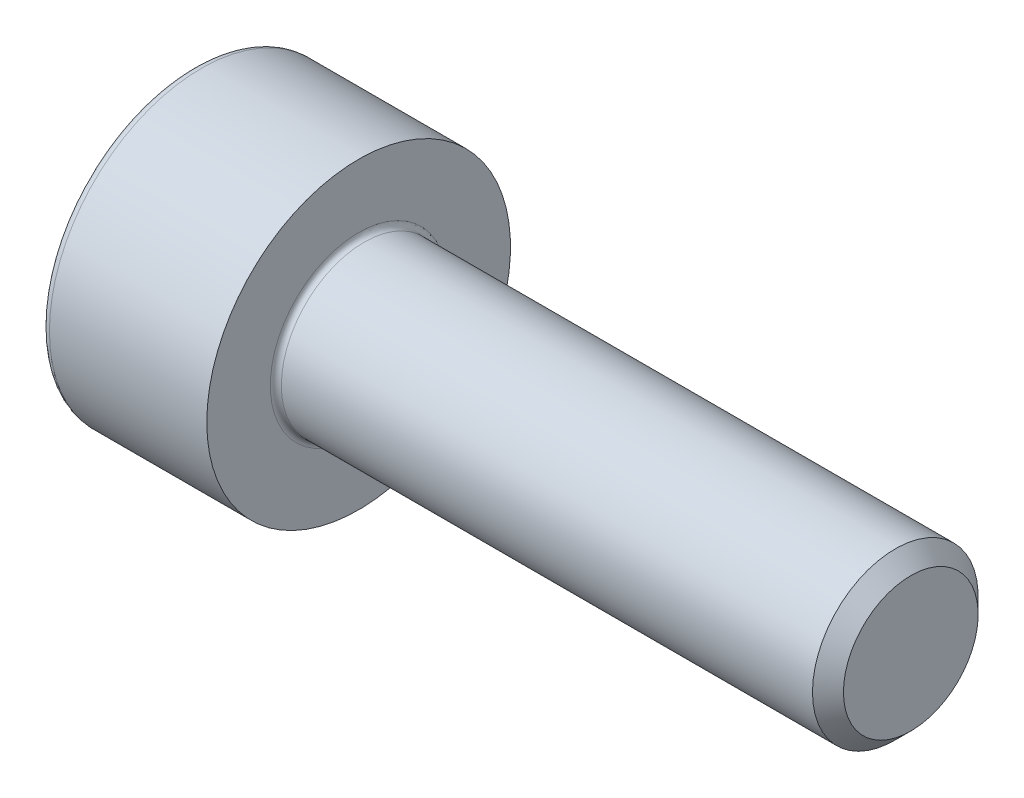
ISO-10303-21;
HEADER;
FILE_DESCRIPTION(('STEP AP214'),'2;1');
FILE_NAME('part.step','',(''),(''),'','','');
FILE_SCHEMA(('AUTOMOTIVE_DESIGN { 1 0 10303 214 1 1 1 1 }'));
ENDSEC;
DATA;
#1=APPLICATION_CONTEXT('core data for automotive mechanical design processes');
#2=APPLICATION_PROTOCOL_DEFINITION('international standard','automotive_design',2000,#1);
#3=PRODUCT_CONTEXT('',#1,'mechanical');
#4=PRODUCT('Part','Part','',(#3));
#5=PRODUCT_RELATED_PRODUCT_CATEGORY('part','',(#4));
#6=PRODUCT_DEFINITION_FORMATION('','',#4);
#7=PRODUCT_DEFINITION_CONTEXT('part definition',#1,'design');
#8=PRODUCT_DEFINITION('design','',#6,#7);
#9=PRODUCT_DEFINITION_SHAPE('','',#8);
#10=(LENGTH_UNIT() NAMED_UNIT(*) SI_UNIT(.MILLI.,.METRE.));
#11=(NAMED_UNIT(*) PLANE_ANGLE_UNIT() SI_UNIT($,.RADIAN.));
#12=(NAMED_UNIT(*) SI_UNIT($,.STERADIAN.) SOLID_ANGLE_UNIT());
#13=UNCERTAINTY_MEASURE_WITH_UNIT(LENGTH_MEASURE(1.E-05),#10,'distance_accuracy_value','');
#14=(GEOMETRIC_REPRESENTATION_CONTEXT(3) GLOBAL_UNCERTAINTY_ASSIGNED_CONTEXT((#13)) GLOBAL_UNIT_ASSIGNED_CONTEXT((#10,
#11,#12)) REPRESENTATION_CONTEXT('',''));
#15=CARTESIAN_POINT('',(0.,0.,0.));
#16=DIRECTION('',(0.,0.,1.));
#17=DIRECTION('',(1.,0.,0.));
#18=AXIS2_PLACEMENT_3D('',#15,#16,#17);
#19=CARTESIAN_POINT('',(0.,0.,0.));
#20=DIRECTION('',(-1.,0.,0.));
#21=DIRECTION('',(0.,0.,1.));
#22=AXIS2_PLACEMENT_3D('',#19,#20,#21);
#23=PLANE('',#22);
#24=CARTESIAN_POINT('',(0.,0.,0.));
#25=DIRECTION('',(-1.,0.,0.));
#26=DIRECTION('',(0.,0.,1.));
#27=AXIS2_PLACEMENT_3D('',#24,#25,#26);
#28=CIRCLE('',#27,2.6);
#29=CARTESIAN_POINT('',(0.,0.,2.6));
#30=VERTEX_POINT('',#29);
#31=EDGE_CURVE('E22',#30,#30,#28,.T.);
#32=ORIENTED_EDGE('',*,*,#31,.T.);
#33=EDGE_LOOP('',(#32));
#34=FACE_BOUND('',#33,.T.);
#35=ADVANCED_FACE('F14',(#34),#23,.T.);
#36=CARTESIAN_POINT('',(-31.75,0.,0.));
#37=DIRECTION('',(-1.,0.,0.));
#38=DIRECTION('',(0.,0.,1.));
#39=AXIS2_PLACEMENT_3D('',#36,#37,#38);
#40=CYLINDRICAL_SURFACE('',#39,2.75);
#41=CARTESIAN_POINT('',(0.149999999999997,0.,0.));
#42=DIRECTION('',(-1.,0.,0.));
#43=DIRECTION('',(0.,0.,1.));
#44=AXIS2_PLACEMENT_3D('',#41,#42,#43);
#45=CIRCLE('',#44,2.75);
#46=CARTESIAN_POINT('',(0.149999999999997,0.,2.75));
#47=VERTEX_POINT('',#46);
#48=EDGE_CURVE('E10',#47,#47,#45,.F.);
#49=ORIENTED_EDGE('',*,*,#48,.T.);
#50=EDGE_LOOP('',(#49));
#51=FACE_BOUND('',#50,.T.);
#52=CARTESIAN_POINT('',(3.,0.,0.));
#53=DIRECTION('',(-1.,0.,0.));
#54=DIRECTION('',(0.,0.,1.));
#55=AXIS2_PLACEMENT_3D('',#52,#53,#54);
#56=CIRCLE('',#55,2.75);
#57=CARTESIAN_POINT('',(3.,0.,2.75));
#58=VERTEX_POINT('',#57);
#59=EDGE_CURVE('E39',#58,#58,#56,.T.);
#60=ORIENTED_EDGE('',*,*,#59,.T.);
#61=EDGE_LOOP('',(#60));
#62=FACE_BOUND('',#61,.T.);
#63=ADVANCED_FACE('F65',(#51,#62),#40,.T.);
#64=CARTESIAN_POINT('',(3.,2.75,0.));
#65=DIRECTION('',(1.,0.,0.));
#66=DIRECTION('',(0.,0.,-1.));
#67=AXIS2_PLACEMENT_3D('',#64,#65,#66);
#68=PLANE('',#67);
#69=CARTESIAN_POINT('',(3.,0.,0.));
#70=DIRECTION('',(1.,0.,0.));
#71=DIRECTION('',(0.,0.,-1.));
#72=AXIS2_PLACEMENT_3D('',#69,#70,#71);
#73=CIRCLE('',#72,1.6);
#74=CARTESIAN_POINT('',(3.,0.,-1.6));
#75=VERTEX_POINT('',#74);
#76=EDGE_CURVE('E34',#75,#75,#73,.F.);
#77=ORIENTED_EDGE('',*,*,#76,.T.);
#78=EDGE_LOOP('',(#77));
#79=FACE_BOUND('',#78,.T.);
#80=ORIENTED_EDGE('',*,*,#59,.F.);
#81=EDGE_LOOP('',(#80));
#82=FACE_BOUND('',#81,.T.);
#83=ADVANCED_FACE('F70',(#79,#82),#68,.T.);
#84=CARTESIAN_POINT('',(-31.75,0.,0.));
#85=DIRECTION('',(-1.,0.,0.));
#86=DIRECTION('',(0.,0.,1.));
#87=AXIS2_PLACEMENT_3D('',#84,#85,#86);
#88=CYLINDRICAL_SURFACE('',#87,1.5);
#89=CARTESIAN_POINT('',(3.1,0.,0.));
#90=DIRECTION('',(1.,0.,0.));
#91=DIRECTION('',(0.,0.,-1.));
#92=AXIS2_PLACEMENT_3D('',#89,#90,#91);
#93=CIRCLE('',#92,1.5);
#94=CARTESIAN_POINT('',(3.1,0.,-1.5));
#95=VERTEX_POINT('',#94);
#96=EDGE_CURVE('E29',#95,#95,#93,.T.);
#97=ORIENTED_EDGE('',*,*,#96,.T.);
#98=EDGE_LOOP('',(#97));
#99=FACE_BOUND('',#98,.T.);
#100=CARTESIAN_POINT('',(12.7195,0.,0.));
#101=DIRECTION('',(-1.,0.,0.));
#102=DIRECTION('',(0.,0.,1.));
#103=AXIS2_PLACEMENT_3D('',#100,#101,#102);
#104=CIRCLE('',#103,1.5);
#105=CARTESIAN_POINT('',(12.7195,0.,1.5));
#106=VERTEX_POINT('',#105);
#107=EDGE_CURVE('E42',#106,#106,#104,.T.);
#108=ORIENTED_EDGE('',*,*,#107,.T.);
#109=EDGE_LOOP('',(#108));
#110=FACE_BOUND('',#109,.T.);
#111=ADVANCED_FACE('F61',(#99,#110),#88,.T.);
#112=CARTESIAN_POINT('',(13.,0.,0.));
#113=DIRECTION('',(-1.,0.,0.));
#114=DIRECTION('',(0.,0.,1.));
#115=AXIS2_PLACEMENT_3D('',#112,#113,#114);
#116=CONICAL_SURFACE('',#115,1.2195,0.785398163397469);
#117=ORIENTED_EDGE('',*,*,#107,.F.);
#118=EDGE_LOOP('',(#117));
#119=FACE_BOUND('',#118,.T.);
#120=CARTESIAN_POINT('',(13.,0.,0.));
#121=DIRECTION('',(-1.,0.,0.));
#122=DIRECTION('',(0.,0.,1.));
#123=AXIS2_PLACEMENT_3D('',#120,#121,#122);
#124=CIRCLE('',#123,1.2195);
#125=CARTESIAN_POINT('',(13.,0.,1.2195));
#126=VERTEX_POINT('',#125);
#127=EDGE_CURVE('E45',#126,#126,#124,.T.);
#128=ORIENTED_EDGE('',*,*,#127,.T.);
#129=EDGE_LOOP('',(#128));
#130=FACE_BOUND('',#129,.T.);
#131=ADVANCED_FACE('F49',(#119,#130),#116,.T.);
#132=CARTESIAN_POINT('',(13.,1.2195,0.));
#133=DIRECTION('',(1.,0.,0.));
#134=DIRECTION('',(0.,0.,-1.));
#135=AXIS2_PLACEMENT_3D('',#132,#133,#134);
#136=PLANE('',#135);
#137=ORIENTED_EDGE('',*,*,#127,.F.);
#138=EDGE_LOOP('',(#137));
#139=FACE_BOUND('',#138,.T.);
#140=ADVANCED_FACE('F51',(#139),#136,.T.);
#141=CARTESIAN_POINT('',(3.1,0.,0.));
#142=DIRECTION('',(1.,0.,0.));
#143=DIRECTION('',(0.,0.,-1.));
#144=AXIS2_PLACEMENT_3D('',#141,#142,#143);
#145=TOROIDAL_SURFACE('',#144,1.6,0.1);
#146=ORIENTED_EDGE('',*,*,#96,.F.);
#147=EDGE_LOOP('',(#146));
#148=FACE_BOUND('',#147,.T.);
#149=ORIENTED_EDGE('',*,*,#76,.F.);
#150=EDGE_LOOP('',(#149));
#151=FACE_BOUND('',#150,.T.);
#152=ADVANCED_FACE('F53',(#148,#151),#145,.F.);
#153=CARTESIAN_POINT('',(0.149999999999997,0.,0.));
#154=DIRECTION('',(-1.,0.,0.));
#155=DIRECTION('',(0.,0.,1.));
#156=AXIS2_PLACEMENT_3D('',#153,#154,#155);
#157=TOROIDAL_SURFACE('',#156,2.6,0.15);
#158=ORIENTED_EDGE('',*,*,#48,.F.);
#159=EDGE_LOOP('',(#158));
#160=FACE_BOUND('',#159,.T.);
#161=ORIENTED_EDGE('',*,*,#31,.F.);
#162=EDGE_LOOP('',(#161));
#163=FACE_BOUND('',#162,.T.);
#164=ADVANCED_FACE('F16',(#160,#163),#157,.T.);
#165=CLOSED_SHELL('',(#35,#63,#83,#111,#131,#140,#152,#164));
#166=MANIFOLD_SOLID_BREP('B1',#165);
#167=ADVANCED_BREP_SHAPE_REPRESENTATION('',(#18,#166),#14);
#168=SHAPE_DEFINITION_REPRESENTATION(#9,#167);
ENDSEC;
END-ISO-10303-21;
